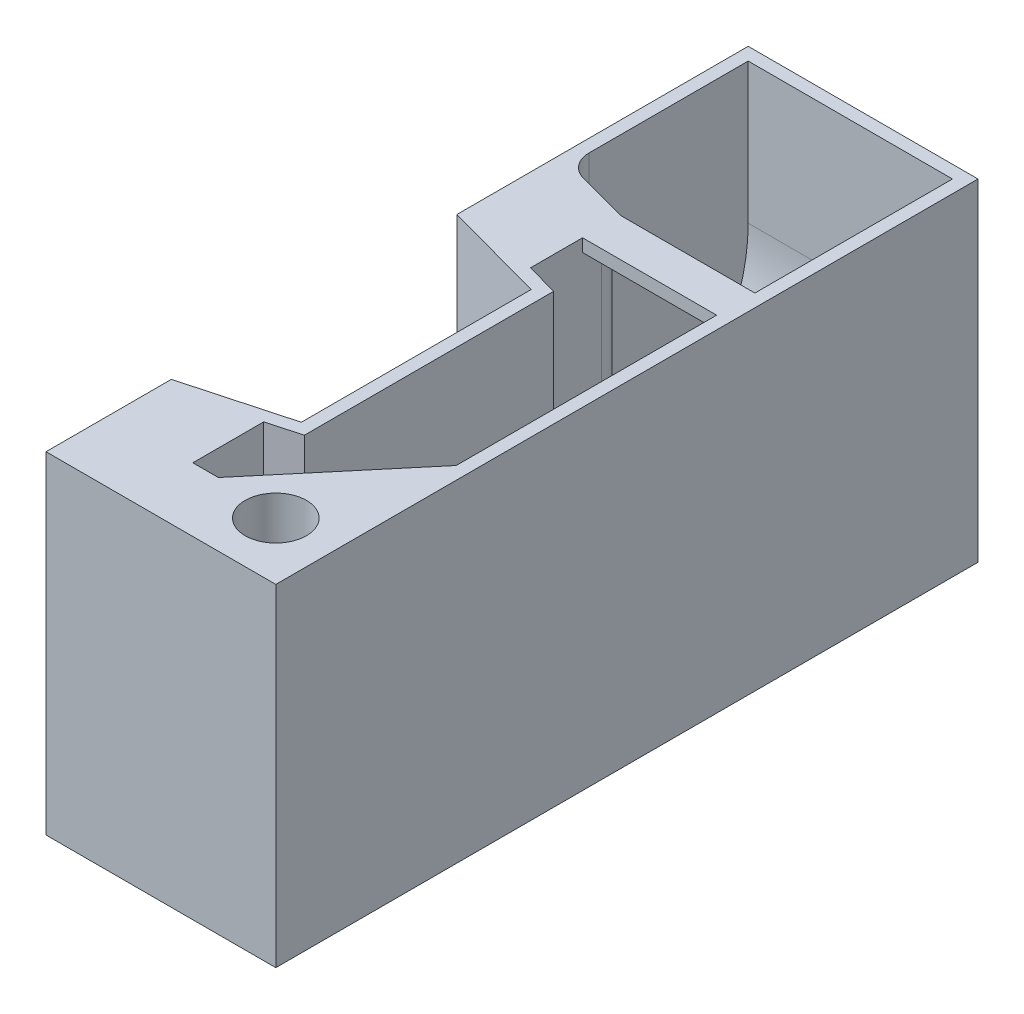
ISO-10303-21;
HEADER;
FILE_DESCRIPTION(('STEP AP214'),'2;1');
FILE_NAME('part.step','',(''),(''),'','','');
FILE_SCHEMA(('AUTOMOTIVE_DESIGN { 1 0 10303 214 1 1 1 1 }'));
ENDSEC;
DATA;
#1=APPLICATION_CONTEXT('core data for automotive mechanical design processes');
#2=APPLICATION_PROTOCOL_DEFINITION('international standard','automotive_design',2000,#1);
#3=PRODUCT_CONTEXT('',#1,'mechanical');
#4=PRODUCT('Part','Part','',(#3));
#5=PRODUCT_RELATED_PRODUCT_CATEGORY('part','',(#4));
#6=PRODUCT_DEFINITION_FORMATION('','',#4);
#7=PRODUCT_DEFINITION_CONTEXT('part definition',#1,'design');
#8=PRODUCT_DEFINITION('design','',#6,#7);
#9=PRODUCT_DEFINITION_SHAPE('','',#8);
#10=(LENGTH_UNIT() NAMED_UNIT(*) SI_UNIT(.MILLI.,.METRE.));
#11=(NAMED_UNIT(*) PLANE_ANGLE_UNIT() SI_UNIT($,.RADIAN.));
#12=(NAMED_UNIT(*) SI_UNIT($,.STERADIAN.) SOLID_ANGLE_UNIT());
#13=UNCERTAINTY_MEASURE_WITH_UNIT(LENGTH_MEASURE(1.E-05),#10,'distance_accuracy_value','');
#14=(GEOMETRIC_REPRESENTATION_CONTEXT(3) GLOBAL_UNCERTAINTY_ASSIGNED_CONTEXT((#13)) GLOBAL_UNIT_ASSIGNED_CONTEXT((#10,
#11,#12)) REPRESENTATION_CONTEXT('',''));
#15=CARTESIAN_POINT('',(0.,0.,0.));
#16=DIRECTION('',(0.,0.,1.));
#17=DIRECTION('',(1.,0.,0.));
#18=AXIS2_PLACEMENT_3D('',#15,#16,#17);
#19=CARTESIAN_POINT('',(13.5,-500000.,-18.5262794416288));
#20=DIRECTION('',(1.,0.,0.));
#21=DIRECTION('',(0.,0.,-1.));
#22=AXIS2_PLACEMENT_3D('',#19,#20,#21);
#23=PLANE('',#22);
#24=DIRECTION('',(0.,0.,-1.));
#25=VECTOR('',#24,1.);
#26=CARTESIAN_POINT('',(13.5,-24.9999999999773,-18.5262794416288));
#27=LINE('',#26,#25);
#28=CARTESIAN_POINT('',(13.5,-24.9999999999773,-15.));
#29=VERTEX_POINT('',#28);
#30=CARTESIAN_POINT('',(13.5,-24.9999999999773,-16.9916254656709));
#31=VERTEX_POINT('',#30);
#32=EDGE_CURVE('E492',#29,#31,#27,.T.);
#33=ORIENTED_EDGE('',*,*,#32,.T.);
#34=DIRECTION('',(0.,1.,0.));
#35=VECTOR('',#34,1.);
#36=CARTESIAN_POINT('',(13.5,-500000.,-16.9916254656709));
#37=LINE('',#36,#35);
#38=CARTESIAN_POINT('',(13.5,-23.1828332696509,-16.9916254656709));
#39=VERTEX_POINT('',#38);
#40=EDGE_CURVE('E474',#31,#39,#37,.T.);
#41=ORIENTED_EDGE('',*,*,#40,.T.);
#42=CARTESIAN_POINT('',(13.5,-23.,-15.));
#43=DIRECTION('',(1.,0.,0.));
#44=DIRECTION('',(0.,0.,-1.));
#45=AXIS2_PLACEMENT_3D('',#42,#43,#44);
#46=CIRCLE('',#45,2.);
#47=EDGE_CURVE('E340',#29,#39,#46,.T.);
#48=ORIENTED_EDGE('',*,*,#47,.F.);
#49=EDGE_LOOP('',(#33,#41,#48));
#50=FACE_BOUND('',#49,.T.);
#51=ADVANCED_FACE('F35',(#50),#23,.T.);
#52=CARTESIAN_POINT('',(13.5,-500000.,9.44605554080685));
#53=DIRECTION('',(1.,0.,0.));
#54=DIRECTION('',(0.,0.,-1.));
#55=AXIS2_PLACEMENT_3D('',#52,#53,#54);
#56=PLANE('',#55);
#57=DIRECTION('',(0.,1.,0.));
#58=VECTOR('',#57,1.);
#59=CARTESIAN_POINT('',(13.5,-26.,15.));
#60=LINE('',#59,#58);
#61=CARTESIAN_POINT('',(13.5,-25.0000000000909,15.));
#62=VERTEX_POINT('',#61);
#63=CARTESIAN_POINT('',(13.5,-23.,15.));
#64=VERTEX_POINT('',#63);
#65=EDGE_CURVE('E599',#62,#64,#60,.T.);
#66=ORIENTED_EDGE('',*,*,#65,.F.);
#67=DIRECTION('',(0.,0.,-1.));
#68=VECTOR('',#67,1.);
#69=CARTESIAN_POINT('',(13.5,-24.9999999999773,9.44605554080685));
#70=LINE('',#69,#68);
#71=CARTESIAN_POINT('',(13.5,-24.9999999999773,13.));
#72=VERTEX_POINT('',#71);
#73=EDGE_CURVE('E559',#62,#72,#70,.T.);
#74=ORIENTED_EDGE('',*,*,#73,.T.);
#75=CARTESIAN_POINT('',(13.5,-23.,13.));
#76=DIRECTION('',(1.,0.,0.));
#77=DIRECTION('',(0.,0.,-1.));
#78=AXIS2_PLACEMENT_3D('',#75,#76,#77);
#79=CIRCLE('',#78,2.);
#80=EDGE_CURVE('E339',#64,#72,#79,.T.);
#81=ORIENTED_EDGE('',*,*,#80,.F.);
#82=EDGE_LOOP('',(#66,#74,#81));
#83=FACE_BOUND('',#82,.T.);
#84=ADVANCED_FACE('F375',(#83),#56,.T.);
#85=CARTESIAN_POINT('',(15.,-26.,-10.));
#86=DIRECTION('',(0.263342239326898,0.,-0.964702474852374));
#87=DIRECTION('',(-0.964702474852374,0.,-0.263342239326898));
#88=AXIS2_PLACEMENT_3D('',#85,#86,#87);
#89=PLANE('',#88);
#90=DIRECTION('',(-0.964702474852374,0.,-0.263342239326898));
#91=VECTOR('',#90,1.);
#92=CARTESIAN_POINT('',(15.,0.,-10.));
#93=LINE('',#92,#91);
#94=CARTESIAN_POINT('',(15.,0.,-10.));
#95=VERTEX_POINT('',#94);
#96=CARTESIAN_POINT('',(7.,0.,-12.1838214055972));
#97=VERTEX_POINT('',#96);
#98=EDGE_CURVE('E284',#95,#97,#93,.T.);
#99=ORIENTED_EDGE('',*,*,#98,.T.);
#100=DIRECTION('',(0.,1.,0.));
#101=VECTOR('',#100,1.);
#102=CARTESIAN_POINT('',(7.,-26.,-12.1838214055972));
#103=LINE('',#102,#101);
#104=CARTESIAN_POINT('',(7.,-26.,-12.1838214055972));
#105=VERTEX_POINT('',#104);
#106=EDGE_CURVE('E321',#105,#97,#103,.T.);
#107=ORIENTED_EDGE('',*,*,#106,.F.);
#108=DIRECTION('',(-0.964702474852374,0.,-0.263342239326898));
#109=VECTOR('',#108,1.);
#110=CARTESIAN_POINT('',(15.,-26.,-10.));
#111=LINE('',#110,#109);
#112=CARTESIAN_POINT('',(15.,-26.,-10.));
#113=VERTEX_POINT('',#112);
#114=EDGE_CURVE('E265',#113,#105,#111,.T.);
#115=ORIENTED_EDGE('',*,*,#114,.F.);
#116=DIRECTION('',(0.,1.,0.));
#117=VECTOR('',#116,1.);
#118=CARTESIAN_POINT('',(15.,-26.,-10.));
#119=LINE('',#118,#117);
#120=EDGE_CURVE('E283',#113,#95,#119,.T.);
#121=ORIENTED_EDGE('',*,*,#120,.T.);
#122=EDGE_LOOP('',(#99,#107,#115,#121));
#123=FACE_BOUND('',#122,.T.);
#124=ADVANCED_FACE('F371',(#123),#89,.F.);
#125=CARTESIAN_POINT('',(7.,-26.,-12.1838214055972));
#126=DIRECTION('',(1.,0.,0.));
#127=DIRECTION('',(0.,0.,-1.));
#128=AXIS2_PLACEMENT_3D('',#125,#126,#127);
#129=PLANE('',#128);
#130=CARTESIAN_POINT('',(7.,-23.,-15.));
#131=DIRECTION('',(-1.,0.,0.));
#132=DIRECTION('',(0.,0.,1.));
#133=AXIS2_PLACEMENT_3D('',#130,#131,#132);
#134=CIRCLE('',#133,2.);
#135=CARTESIAN_POINT('',(7.,-23.,-13.));
#136=VERTEX_POINT('',#135);
#137=EDGE_CURVE('E594',#136,#136,#134,.T.);
#138=ORIENTED_EDGE('',*,*,#137,.F.);
#139=EDGE_LOOP('',(#138));
#140=FACE_BOUND('',#139,.T.);
#141=DIRECTION('',(0.,0.,-1.));
#142=VECTOR('',#141,1.);
#143=CARTESIAN_POINT('',(7.,0.,-12.1838214055972));
#144=LINE('',#143,#142);
#145=CARTESIAN_POINT('',(7.00000000000001,0.,-35.));
#146=VERTEX_POINT('',#145);
#147=EDGE_CURVE('E287',#97,#146,#144,.T.);
#148=ORIENTED_EDGE('',*,*,#147,.T.);
#149=DIRECTION('',(0.,1.,0.));
#150=VECTOR('',#149,1.);
#151=CARTESIAN_POINT('',(7.00000000000001,-26.,-35.));
#152=LINE('',#151,#150);
#153=CARTESIAN_POINT('',(7.00000000000001,-26.,-35.));
#154=VERTEX_POINT('',#153);
#155=EDGE_CURVE('E318',#154,#146,#152,.T.);
#156=ORIENTED_EDGE('',*,*,#155,.F.);
#157=DIRECTION('',(0.,0.,-1.));
#158=VECTOR('',#157,1.);
#159=CARTESIAN_POINT('',(7.,-26.,-12.1838214055972));
#160=LINE('',#159,#158);
#161=EDGE_CURVE('E268',#105,#154,#160,.T.);
#162=ORIENTED_EDGE('',*,*,#161,.F.);
#163=ORIENTED_EDGE('',*,*,#106,.T.);
#164=EDGE_LOOP('',(#148,#156,#162,#163));
#165=FACE_BOUND('',#164,.T.);
#166=ADVANCED_FACE('F374',(#140,#165),#129,.F.);
#167=CARTESIAN_POINT('',(7.00000000000001,-26.,-35.));
#168=DIRECTION('',(0.,0.,1.));
#169=DIRECTION('',(1.,0.,0.));
#170=AXIS2_PLACEMENT_3D('',#167,#168,#169);
#171=PLANE('',#170);
#172=DIRECTION('',(1.,0.,0.));
#173=VECTOR('',#172,1.);
#174=CARTESIAN_POINT('',(7.00000000000001,0.,-35.));
#175=LINE('',#174,#173);
#176=CARTESIAN_POINT('',(25.,0.,-35.));
#177=VERTEX_POINT('',#176);
#178=EDGE_CURVE('E290',#146,#177,#175,.T.);
#179=ORIENTED_EDGE('',*,*,#178,.T.);
#180=DIRECTION('',(0.,1.,0.));
#181=VECTOR('',#180,1.);
#182=CARTESIAN_POINT('',(25.,-26.,-35.));
#183=LINE('',#182,#181);
#184=CARTESIAN_POINT('',(25.,-26.,-35.));
#185=VERTEX_POINT('',#184);
#186=EDGE_CURVE('E315',#185,#177,#183,.T.);
#187=ORIENTED_EDGE('',*,*,#186,.F.);
#188=DIRECTION('',(1.,0.,0.));
#189=VECTOR('',#188,1.);
#190=CARTESIAN_POINT('',(7.00000000000001,-26.,-35.));
#191=LINE('',#190,#189);
#192=EDGE_CURVE('E271',#154,#185,#191,.T.);
#193=ORIENTED_EDGE('',*,*,#192,.F.);
#194=ORIENTED_EDGE('',*,*,#155,.T.);
#195=EDGE_LOOP('',(#179,#187,#193,#194));
#196=FACE_BOUND('',#195,.T.);
#197=ADVANCED_FACE('F379',(#196),#171,.F.);
#198=CARTESIAN_POINT('',(25.,-26.,-35.));
#199=DIRECTION('',(-1.,0.,0.));
#200=DIRECTION('',(0.,0.,1.));
#201=AXIS2_PLACEMENT_3D('',#198,#199,#200);
#202=PLANE('',#201);
#203=DIRECTION('',(0.,0.,1.));
#204=VECTOR('',#203,1.);
#205=CARTESIAN_POINT('',(25.,0.,-35.));
#206=LINE('',#205,#204);
#207=CARTESIAN_POINT('',(25.,0.,20.));
#208=VERTEX_POINT('',#207);
#209=EDGE_CURVE('E292',#177,#208,#206,.T.);
#210=ORIENTED_EDGE('',*,*,#209,.T.);
#211=DIRECTION('',(0.,1.,0.));
#212=VECTOR('',#211,1.);
#213=CARTESIAN_POINT('',(25.,-26.,20.));
#214=LINE('',#213,#212);
#215=CARTESIAN_POINT('',(25.,-26.,20.));
#216=VERTEX_POINT('',#215);
#217=EDGE_CURVE('E312',#216,#208,#214,.T.);
#218=ORIENTED_EDGE('',*,*,#217,.F.);
#219=DIRECTION('',(0.,0.,1.));
#220=VECTOR('',#219,1.);
#221=CARTESIAN_POINT('',(25.,-26.,-35.));
#222=LINE('',#221,#220);
#223=EDGE_CURVE('E273',#185,#216,#222,.T.);
#224=ORIENTED_EDGE('',*,*,#223,.F.);
#225=ORIENTED_EDGE('',*,*,#186,.T.);
#226=EDGE_LOOP('',(#210,#218,#224,#225));
#227=FACE_BOUND('',#226,.T.);
#228=ADVANCED_FACE('F383',(#227),#202,.F.);
#229=CARTESIAN_POINT('',(25.,-26.,20.));
#230=DIRECTION('',(0.,0.,-1.));
#231=DIRECTION('',(-1.,0.,0.));
#232=AXIS2_PLACEMENT_3D('',#229,#230,#231);
#233=PLANE('',#232);
#234=DIRECTION('',(-1.,0.,0.));
#235=VECTOR('',#234,1.);
#236=CARTESIAN_POINT('',(25.,0.,20.));
#237=LINE('',#236,#235);
#238=CARTESIAN_POINT('',(7.,0.,20.));
#239=VERTEX_POINT('',#238);
#240=EDGE_CURVE('E294',#208,#239,#237,.T.);
#241=ORIENTED_EDGE('',*,*,#240,.T.);
#242=DIRECTION('',(0.,1.,0.));
#243=VECTOR('',#242,1.);
#244=CARTESIAN_POINT('',(7.,-26.,20.));
#245=LINE('',#244,#243);
#246=CARTESIAN_POINT('',(7.,-26.,20.));
#247=VERTEX_POINT('',#246);
#248=EDGE_CURVE('E309',#247,#239,#245,.T.);
#249=ORIENTED_EDGE('',*,*,#248,.F.);
#250=DIRECTION('',(-1.,0.,0.));
#251=VECTOR('',#250,1.);
#252=CARTESIAN_POINT('',(25.,-26.,20.));
#253=LINE('',#252,#251);
#254=EDGE_CURVE('E275',#216,#247,#253,.T.);
#255=ORIENTED_EDGE('',*,*,#254,.F.);
#256=ORIENTED_EDGE('',*,*,#217,.T.);
#257=EDGE_LOOP('',(#241,#249,#255,#256));
#258=FACE_BOUND('',#257,.T.);
#259=ADVANCED_FACE('F387',(#258),#233,.F.);
#260=CARTESIAN_POINT('',(7.,-26.,20.));
#261=DIRECTION('',(1.,0.,0.));
#262=DIRECTION('',(0.,0.,-1.));
#263=AXIS2_PLACEMENT_3D('',#260,#261,#262);
#264=PLANE('',#263);
#265=CARTESIAN_POINT('',(7.,-23.,13.));
#266=DIRECTION('',(-1.,0.,0.));
#267=DIRECTION('',(0.,0.,1.));
#268=AXIS2_PLACEMENT_3D('',#265,#266,#267);
#269=CIRCLE('',#268,2.);
#270=CARTESIAN_POINT('',(7.,-23.,15.));
#271=VERTEX_POINT('',#270);
#272=EDGE_CURVE('E591',#271,#271,#269,.T.);
#273=ORIENTED_EDGE('',*,*,#272,.F.);
#274=EDGE_LOOP('',(#273));
#275=FACE_BOUND('',#274,.T.);
#276=DIRECTION('',(0.,0.,-1.));
#277=VECTOR('',#276,1.);
#278=CARTESIAN_POINT('',(7.,0.,20.));
#279=LINE('',#278,#277);
#280=CARTESIAN_POINT('',(7.,0.,10.1838214055972));
#281=VERTEX_POINT('',#280);
#282=EDGE_CURVE('E296',#239,#281,#279,.T.);
#283=ORIENTED_EDGE('',*,*,#282,.T.);
#284=DIRECTION('',(0.,1.,0.));
#285=VECTOR('',#284,1.);
#286=CARTESIAN_POINT('',(7.,-26.,10.1838214055972));
#287=LINE('',#286,#285);
#288=CARTESIAN_POINT('',(7.,-26.,10.1838214055972));
#289=VERTEX_POINT('',#288);
#290=EDGE_CURVE('E306',#289,#281,#287,.T.);
#291=ORIENTED_EDGE('',*,*,#290,.F.);
#292=DIRECTION('',(0.,0.,-1.));
#293=VECTOR('',#292,1.);
#294=CARTESIAN_POINT('',(7.,-26.,20.));
#295=LINE('',#294,#293);
#296=EDGE_CURVE('E277',#247,#289,#295,.T.);
#297=ORIENTED_EDGE('',*,*,#296,.F.);
#298=ORIENTED_EDGE('',*,*,#248,.T.);
#299=EDGE_LOOP('',(#283,#291,#297,#298));
#300=FACE_BOUND('',#299,.T.);
#301=ADVANCED_FACE('F391',(#275,#300),#264,.F.);
#302=CARTESIAN_POINT('',(7.,-26.,10.1838214055972));
#303=DIRECTION('',(0.263342239326903,0.,0.964702474852372));
#304=DIRECTION('',(0.964702474852372,0.,-0.263342239326903));
#305=AXIS2_PLACEMENT_3D('',#302,#303,#304);
#306=PLANE('',#305);
#307=DIRECTION('',(0.964702474852372,0.,-0.263342239326903));
#308=VECTOR('',#307,1.);
#309=CARTESIAN_POINT('',(7.,0.,10.1838214055972));
#310=LINE('',#309,#308);
#311=CARTESIAN_POINT('',(15.,0.,8.));
#312=VERTEX_POINT('',#311);
#313=EDGE_CURVE('E298',#281,#312,#310,.T.);
#314=ORIENTED_EDGE('',*,*,#313,.T.);
#315=DIRECTION('',(0.,1.,0.));
#316=VECTOR('',#315,1.);
#317=CARTESIAN_POINT('',(15.,-26.,8.));
#318=LINE('',#317,#316);
#319=CARTESIAN_POINT('',(15.,-26.,8.));
#320=VERTEX_POINT('',#319);
#321=EDGE_CURVE('E303',#320,#312,#318,.T.);
#322=ORIENTED_EDGE('',*,*,#321,.F.);
#323=DIRECTION('',(0.964702474852372,0.,-0.263342239326903));
#324=VECTOR('',#323,1.);
#325=CARTESIAN_POINT('',(7.,-26.,10.1838214055972));
#326=LINE('',#325,#324);
#327=EDGE_CURVE('E279',#289,#320,#326,.T.);
#328=ORIENTED_EDGE('',*,*,#327,.F.);
#329=ORIENTED_EDGE('',*,*,#290,.T.);
#330=EDGE_LOOP('',(#314,#322,#328,#329));
#331=FACE_BOUND('',#330,.T.);
#332=ADVANCED_FACE('F395',(#331),#306,.F.);
#333=CARTESIAN_POINT('',(15.,-26.,8.));
#334=DIRECTION('',(1.,0.,0.));
#335=DIRECTION('',(0.,0.,-1.));
#336=AXIS2_PLACEMENT_3D('',#333,#334,#335);
#337=PLANE('',#336);
#338=DIRECTION('',(0.,0.,-1.));
#339=VECTOR('',#338,1.);
#340=CARTESIAN_POINT('',(15.,0.,8.));
#341=LINE('',#340,#339);
#342=EDGE_CURVE('E269',#312,#95,#341,.T.);
#343=ORIENTED_EDGE('',*,*,#342,.T.);
#344=ORIENTED_EDGE('',*,*,#120,.F.);
#345=DIRECTION('',(0.,0.,-1.));
#346=VECTOR('',#345,1.);
#347=CARTESIAN_POINT('',(15.,-26.,8.));
#348=LINE('',#347,#346);
#349=EDGE_CURVE('E281',#320,#113,#348,.T.);
#350=ORIENTED_EDGE('',*,*,#349,.F.);
#351=ORIENTED_EDGE('',*,*,#321,.T.);
#352=EDGE_LOOP('',(#343,#344,#350,#351));
#353=FACE_BOUND('',#352,.T.);
#354=ADVANCED_FACE('F399',(#353),#337,.F.);
#355=CARTESIAN_POINT('',(0.,-26.,0.));
#356=DIRECTION('',(0.,-1.,0.));
#357=DIRECTION('',(0.,0.,-1.));
#358=AXIS2_PLACEMENT_3D('',#355,#356,#357);
#359=PLANE('',#358);
#360=ORIENTED_EDGE('',*,*,#114,.T.);
#361=ORIENTED_EDGE('',*,*,#161,.T.);
#362=ORIENTED_EDGE('',*,*,#192,.T.);
#363=ORIENTED_EDGE('',*,*,#223,.T.);
#364=ORIENTED_EDGE('',*,*,#254,.T.);
#365=ORIENTED_EDGE('',*,*,#296,.T.);
#366=ORIENTED_EDGE('',*,*,#327,.T.);
#367=ORIENTED_EDGE('',*,*,#349,.T.);
#368=EDGE_LOOP('',(#360,#361,#362,#363,#364,#365,#366,#367));
#369=FACE_BOUND('',#368,.T.);
#370=ADVANCED_FACE('F403',(#369),#359,.T.);
#371=CARTESIAN_POINT('',(0.,0.,0.));
#372=DIRECTION('',(0.,-1.,0.));
#373=DIRECTION('',(0.,0.,-1.));
#374=AXIS2_PLACEMENT_3D('',#371,#372,#373);
#375=PLANE('',#374);
#376=CARTESIAN_POINT('',(20.5,0.,15.5));
#377=DIRECTION('',(0.,1.,0.));
#378=DIRECTION('',(0.,0.,1.));
#379=AXIS2_PLACEMENT_3D('',#376,#377,#378);
#380=CIRCLE('',#379,2.4);
#381=CARTESIAN_POINT('',(20.5,0.,17.9));
#382=VERTEX_POINT('',#381);
#383=EDGE_CURVE('E605',#382,#382,#380,.T.);
#384=ORIENTED_EDGE('',*,*,#383,.F.);
#385=EDGE_LOOP('',(#384));
#386=FACE_BOUND('',#385,.T.);
#387=DIRECTION('',(0.,0.,1.));
#388=VECTOR('',#387,1.);
#389=CARTESIAN_POINT('',(24.,0.,-35.));
#390=LINE('',#389,#388);
#391=CARTESIAN_POINT('',(24.,0.,-15.5262794416288));
#392=VERTEX_POINT('',#391);
#393=CARTESIAN_POINT('',(24.,0.,4.87009446294933));
#394=VERTEX_POINT('',#393);
#395=EDGE_CURVE('E243',#392,#394,#390,.T.);
#396=ORIENTED_EDGE('',*,*,#395,.T.);
#397=DIRECTION('',(-0.642787609686543,0.,0.766044443118974));
#398=VECTOR('',#397,1.);
#399=CARTESIAN_POINT('',(24.,0.,4.87009446294933));
#400=LINE('',#399,#398);
#401=CARTESIAN_POINT('',(15.5,0.,15.));
#402=VERTEX_POINT('',#401);
#403=EDGE_CURVE('E224',#394,#402,#400,.T.);
#404=ORIENTED_EDGE('',*,*,#403,.T.);
#405=DIRECTION('',(-1.,0.,0.));
#406=VECTOR('',#405,1.);
#407=CARTESIAN_POINT('',(13.5,0.,15.));
#408=LINE('',#407,#406);
#409=CARTESIAN_POINT('',(13.5,0.,15.));
#410=VERTEX_POINT('',#409);
#411=EDGE_CURVE('E235',#402,#410,#408,.T.);
#412=ORIENTED_EDGE('',*,*,#411,.T.);
#413=DIRECTION('',(0.,0.,-1.));
#414=VECTOR('',#413,1.);
#415=CARTESIAN_POINT('',(13.5,0.,9.44605554080685));
#416=LINE('',#415,#414);
#417=CARTESIAN_POINT('',(13.5,0.,9.44605554080685));
#418=VERTEX_POINT('',#417);
#419=EDGE_CURVE('E498',#410,#418,#416,.T.);
#420=ORIENTED_EDGE('',*,*,#419,.T.);
#421=DIRECTION('',(0.964702474852372,0.,-0.263342239326903));
#422=VECTOR('',#421,1.);
#423=CARTESIAN_POINT('',(7.2633422393269,0.,11.1485238804496));
#424=LINE('',#423,#422);
#425=CARTESIAN_POINT('',(16.,0.,8.76361135155772));
#426=VERTEX_POINT('',#425);
#427=EDGE_CURVE('E256',#418,#426,#424,.T.);
#428=ORIENTED_EDGE('',*,*,#427,.T.);
#429=DIRECTION('',(0.,0.,-1.));
#430=VECTOR('',#429,1.);
#431=CARTESIAN_POINT('',(16.,0.,8.));
#432=LINE('',#431,#430);
#433=CARTESIAN_POINT('',(16.,0.,-10.7636113515577));
#434=VERTEX_POINT('',#433);
#435=EDGE_CURVE('E516',#426,#434,#432,.T.);
#436=ORIENTED_EDGE('',*,*,#435,.T.);
#437=DIRECTION('',(-0.964702474852374,0.,-0.263342239326898));
#438=VECTOR('',#437,1.);
#439=CARTESIAN_POINT('',(15.2633422393269,0.,-10.9647024748524));
#440=LINE('',#439,#438);
#441=CARTESIAN_POINT('',(13.5,0.,-11.4460555408068));
#442=VERTEX_POINT('',#441);
#443=EDGE_CURVE('E264',#434,#442,#440,.T.);
#444=ORIENTED_EDGE('',*,*,#443,.T.);
#445=DIRECTION('',(0.,0.,-1.));
#446=VECTOR('',#445,1.);
#447=CARTESIAN_POINT('',(13.5,0.,-18.5262794416288));
#448=LINE('',#447,#446);
#449=CARTESIAN_POINT('',(13.5,0.,-15.5262794416288));
#450=VERTEX_POINT('',#449);
#451=EDGE_CURVE('E506',#442,#450,#448,.T.);
#452=ORIENTED_EDGE('',*,*,#451,.T.);
#453=DIRECTION('',(1.,0.,0.));
#454=VECTOR('',#453,1.);
#455=CARTESIAN_POINT('',(24.,0.,-15.5262794416288));
#456=LINE('',#455,#454);
#457=EDGE_CURVE('E250',#450,#392,#456,.T.);
#458=ORIENTED_EDGE('',*,*,#457,.T.);
#459=EDGE_LOOP('',(#396,#404,#412,#420,#428,#436,#444,#452,#458));
#460=FACE_BOUND('',#459,.T.);
#461=CARTESIAN_POINT('',(24.,0.,-34.));
#462=VERTEX_POINT('',#461);
#463=CARTESIAN_POINT('',(24.,0.,-18.5262794416288));
#464=VERTEX_POINT('',#463);
#465=EDGE_CURVE('E252',#462,#464,#390,.T.);
#466=ORIENTED_EDGE('',*,*,#465,.T.);
#467=DIRECTION('',(-1.,0.,0.));
#468=VECTOR('',#467,1.);
#469=CARTESIAN_POINT('',(24.,0.,-18.5262794416288));
#470=LINE('',#469,#468);
#471=CARTESIAN_POINT('',(13.5,0.,-18.5262794416288));
#472=VERTEX_POINT('',#471);
#473=EDGE_CURVE('E343',#464,#472,#470,.T.);
#474=ORIENTED_EDGE('',*,*,#473,.T.);
#475=DIRECTION('',(-0.965925826289067,0.,-0.258819045102525));
#476=VECTOR('',#475,1.);
#477=CARTESIAN_POINT('',(8.,0.,-20.));
#478=LINE('',#477,#476);
#479=CARTESIAN_POINT('',(9.48236190979495,0.,-19.6028023233798));
#480=VERTEX_POINT('',#479);
#481=EDGE_CURVE('E508',#472,#480,#478,.T.);
#482=ORIENTED_EDGE('',*,*,#481,.T.);
#483=CARTESIAN_POINT('',(10.,0.,-21.5346539759579));
#484=DIRECTION('',(0.,-1.,0.));
#485=DIRECTION('',(0.,0.,-1.));
#486=AXIS2_PLACEMENT_3D('',#483,#484,#485);
#487=CIRCLE('',#486,2.);
#488=CARTESIAN_POINT('',(8.,0.,-21.5346539759579));
#489=VERTEX_POINT('',#488);
#490=EDGE_CURVE('E473',#480,#489,#487,.T.);
#491=ORIENTED_EDGE('',*,*,#490,.T.);
#492=DIRECTION('',(0.,0.,-1.));
#493=VECTOR('',#492,1.);
#494=CARTESIAN_POINT('',(8.,0.,-12.1838214055972));
#495=LINE('',#494,#493);
#496=CARTESIAN_POINT('',(8.00000000000001,0.,-34.));
#497=VERTEX_POINT('',#496);
#498=EDGE_CURVE('E258',#489,#497,#495,.T.);
#499=ORIENTED_EDGE('',*,*,#498,.T.);
#500=DIRECTION('',(1.,0.,0.));
#501=VECTOR('',#500,1.);
#502=CARTESIAN_POINT('',(7.00000000000001,0.,-34.));
#503=LINE('',#502,#501);
#504=EDGE_CURVE('E253',#497,#462,#503,.T.);
#505=ORIENTED_EDGE('',*,*,#504,.T.);
#506=EDGE_LOOP('',(#466,#474,#482,#491,#499,#505));
#507=FACE_BOUND('',#506,.T.);
#508=ORIENTED_EDGE('',*,*,#98,.F.);
#509=ORIENTED_EDGE('',*,*,#342,.F.);
#510=ORIENTED_EDGE('',*,*,#313,.F.);
#511=ORIENTED_EDGE('',*,*,#282,.F.);
#512=ORIENTED_EDGE('',*,*,#240,.F.);
#513=ORIENTED_EDGE('',*,*,#209,.F.);
#514=ORIENTED_EDGE('',*,*,#178,.F.);
#515=ORIENTED_EDGE('',*,*,#147,.F.);
#516=EDGE_LOOP('',(#508,#509,#510,#511,#512,#513,#514,#515));
#517=FACE_BOUND('',#516,.T.);
#518=ADVANCED_FACE('F247',(#386,#460,#507,#517),#375,.F.);
#519=CARTESIAN_POINT('',(15.2633422393269,-26.,-10.9647024748524));
#520=DIRECTION('',(0.263342239326898,0.,-0.964702474852374));
#521=DIRECTION('',(-0.964702474852374,0.,-0.263342239326898));
#522=AXIS2_PLACEMENT_3D('',#519,#520,#521);
#523=PLANE('',#522);
#524=DIRECTION('',(0.,1.,0.));
#525=VECTOR('',#524,1.);
#526=CARTESIAN_POINT('',(13.5,-500000.,-11.4460555408068));
#527=LINE('',#526,#525);
#528=CARTESIAN_POINT('',(13.5,-25.,-11.4460555408068));
#529=VERTEX_POINT('',#528);
#530=EDGE_CURVE('E505',#529,#442,#527,.T.);
#531=ORIENTED_EDGE('',*,*,#530,.T.);
#532=ORIENTED_EDGE('',*,*,#443,.F.);
#533=DIRECTION('',(0.,1.,0.));
#534=VECTOR('',#533,1.);
#535=CARTESIAN_POINT('',(16.,-26.,-10.7636113515577));
#536=LINE('',#535,#534);
#537=CARTESIAN_POINT('',(16.,-25.,-10.7636113515577));
#538=VERTEX_POINT('',#537);
#539=EDGE_CURVE('E517',#538,#434,#536,.T.);
#540=ORIENTED_EDGE('',*,*,#539,.F.);
#541=DIRECTION('',(-0.964702474852374,0.,-0.263342239326898));
#542=VECTOR('',#541,1.);
#543=CARTESIAN_POINT('',(15.2633422393269,-25.,-10.9647024748524));
#544=LINE('',#543,#542);
#545=EDGE_CURVE('E513',#538,#529,#544,.T.);
#546=ORIENTED_EDGE('',*,*,#545,.T.);
#547=EDGE_LOOP('',(#531,#532,#540,#546));
#548=FACE_BOUND('',#547,.T.);
#549=ADVANCED_FACE('F407',(#548),#523,.T.);
#550=CARTESIAN_POINT('',(8.,-26.,-12.1838214055972));
#551=DIRECTION('',(1.,0.,0.));
#552=DIRECTION('',(0.,0.,-1.));
#553=AXIS2_PLACEMENT_3D('',#550,#551,#552);
#554=PLANE('',#553);
#555=ORIENTED_EDGE('',*,*,#498,.F.);
#556=DIRECTION('',(0.,1.,0.));
#557=VECTOR('',#556,1.);
#558=CARTESIAN_POINT('',(8.,-24.9999999999773,-21.5346539759579));
#559=LINE('',#558,#557);
#560=CARTESIAN_POINT('',(8.,-24.9156328341214,-21.5346539759579));
#561=VERTEX_POINT('',#560);
#562=EDGE_CURVE('E351',#489,#561,#559,.F.);
#563=ORIENTED_EDGE('',*,*,#562,.T.);
#564=CARTESIAN_POINT('',(8.,-11.,-20.));
#565=DIRECTION('',(1.,0.,0.));
#566=DIRECTION('',(0.,0.,-1.));
#567=AXIS2_PLACEMENT_3D('',#564,#565,#566);
#568=CIRCLE('',#567,14.);
#569=CARTESIAN_POINT('',(8.00000000000001,-11.,-34.));
#570=VERTEX_POINT('',#569);
#571=EDGE_CURVE('E332',#561,#570,#568,.T.);
#572=ORIENTED_EDGE('',*,*,#571,.T.);
#573=DIRECTION('',(0.,1.,0.));
#574=VECTOR('',#573,1.);
#575=CARTESIAN_POINT('',(8.00000000000001,-26.,-34.));
#576=LINE('',#575,#574);
#577=EDGE_CURVE('E288',#570,#497,#576,.T.);
#578=ORIENTED_EDGE('',*,*,#577,.T.);
#579=EDGE_LOOP('',(#555,#563,#572,#578));
#580=FACE_BOUND('',#579,.T.);
#581=ADVANCED_FACE('F428',(#580),#554,.T.);
#582=CARTESIAN_POINT('',(7.00000000000001,-26.,-34.));
#583=DIRECTION('',(0.,0.,1.));
#584=DIRECTION('',(1.,0.,0.));
#585=AXIS2_PLACEMENT_3D('',#582,#583,#584);
#586=PLANE('',#585);
#587=ORIENTED_EDGE('',*,*,#577,.F.);
#588=DIRECTION('',(1.,0.,0.));
#589=VECTOR('',#588,1.);
#590=CARTESIAN_POINT('',(7.00000000000001,-11.,-34.));
#591=LINE('',#590,#589);
#592=CARTESIAN_POINT('',(24.,-11.,-34.));
#593=VERTEX_POINT('',#592);
#594=EDGE_CURVE('E324',#570,#593,#591,.T.);
#595=ORIENTED_EDGE('',*,*,#594,.T.);
#596=DIRECTION('',(0.,1.,0.));
#597=VECTOR('',#596,1.);
#598=CARTESIAN_POINT('',(24.,-26.,-34.));
#599=LINE('',#598,#597);
#600=EDGE_CURVE('E523',#593,#462,#599,.T.);
#601=ORIENTED_EDGE('',*,*,#600,.T.);
#602=ORIENTED_EDGE('',*,*,#504,.F.);
#603=EDGE_LOOP('',(#587,#595,#601,#602));
#604=FACE_BOUND('',#603,.T.);
#605=ADVANCED_FACE('F425',(#604),#586,.T.);
#606=CARTESIAN_POINT('',(24.,-26.,-35.));
#607=DIRECTION('',(-1.,0.,0.));
#608=DIRECTION('',(0.,0.,1.));
#609=AXIS2_PLACEMENT_3D('',#606,#607,#608);
#610=PLANE('',#609);
#611=DIRECTION('',(0.,1.,0.));
#612=VECTOR('',#611,1.);
#613=CARTESIAN_POINT('',(24.,-26.,4.87009446294933));
#614=LINE('',#613,#612);
#615=CARTESIAN_POINT('',(24.,-25.,4.87009446294933));
#616=VERTEX_POINT('',#615);
#617=EDGE_CURVE('E227',#616,#394,#614,.T.);
#618=ORIENTED_EDGE('',*,*,#617,.T.);
#619=ORIENTED_EDGE('',*,*,#395,.F.);
#620=DIRECTION('',(0.,1.,0.));
#621=VECTOR('',#620,1.);
#622=CARTESIAN_POINT('',(24.,-1.,-15.5262794416288));
#623=LINE('',#622,#621);
#624=CARTESIAN_POINT('',(24.,-1.,-15.5262794416288));
#625=VERTEX_POINT('',#624);
#626=EDGE_CURVE('E548',#625,#392,#623,.T.);
#627=ORIENTED_EDGE('',*,*,#626,.F.);
#628=DIRECTION('',(0.,0.,-1.));
#629=VECTOR('',#628,1.);
#630=CARTESIAN_POINT('',(24.,-1.,-15.5262794416288));
#631=LINE('',#630,#629);
#632=CARTESIAN_POINT('',(24.,-1.,-18.5262794416288));
#633=VERTEX_POINT('',#632);
#634=EDGE_CURVE('E583',#625,#633,#631,.T.);
#635=ORIENTED_EDGE('',*,*,#634,.T.);
#636=DIRECTION('',(0.,1.,0.));
#637=VECTOR('',#636,1.);
#638=CARTESIAN_POINT('',(24.,-1.,-18.5262794416288));
#639=LINE('',#638,#637);
#640=EDGE_CURVE('E552',#633,#464,#639,.T.);
#641=ORIENTED_EDGE('',*,*,#640,.T.);
#642=ORIENTED_EDGE('',*,*,#465,.F.);
#643=ORIENTED_EDGE('',*,*,#600,.F.);
#644=CARTESIAN_POINT('',(24.,-11.,-20.));
#645=DIRECTION('',(-1.,0.,0.));
#646=DIRECTION('',(0.,0.,1.));
#647=AXIS2_PLACEMENT_3D('',#644,#645,#646);
#648=CIRCLE('',#647,14.);
#649=CARTESIAN_POINT('',(24.,-25.,-20.));
#650=VERTEX_POINT('',#649);
#651=EDGE_CURVE('E327',#593,#650,#648,.T.);
#652=ORIENTED_EDGE('',*,*,#651,.T.);
#653=DIRECTION('',(0.,0.,1.));
#654=VECTOR('',#653,1.);
#655=CARTESIAN_POINT('',(24.,-25.,-35.));
#656=LINE('',#655,#654);
#657=EDGE_CURVE('E245',#650,#616,#656,.T.);
#658=ORIENTED_EDGE('',*,*,#657,.T.);
#659=EDGE_LOOP('',(#618,#619,#627,#635,#641,#642,#643,#652,#658));
#660=FACE_BOUND('',#659,.T.);
#661=ADVANCED_FACE('F241',(#660),#610,.T.);
#662=CARTESIAN_POINT('',(7.2633422393269,-26.,11.1485238804496));
#663=DIRECTION('',(0.263342239326903,0.,0.964702474852372));
#664=DIRECTION('',(0.964702474852372,0.,-0.263342239326903));
#665=AXIS2_PLACEMENT_3D('',#662,#663,#664);
#666=PLANE('',#665);
#667=DIRECTION('',(0.,1.,0.));
#668=VECTOR('',#667,1.);
#669=CARTESIAN_POINT('',(13.5,-500000.,9.44605554080685));
#670=LINE('',#669,#668);
#671=CARTESIAN_POINT('',(13.5,-25.0000000000909,9.44605554080685));
#672=VERTEX_POINT('',#671);
#673=EDGE_CURVE('E500',#672,#418,#670,.T.);
#674=ORIENTED_EDGE('',*,*,#673,.F.);
#675=DIRECTION('',(0.964702474852372,0.,-0.263342239326903));
#676=VECTOR('',#675,1.);
#677=CARTESIAN_POINT('',(7.2633422393269,-25.,11.1485238804496));
#678=LINE('',#677,#676);
#679=CARTESIAN_POINT('',(16.,-25.,8.76361135155772));
#680=VERTEX_POINT('',#679);
#681=EDGE_CURVE('E526',#672,#680,#678,.T.);
#682=ORIENTED_EDGE('',*,*,#681,.T.);
#683=DIRECTION('',(0.,1.,0.));
#684=VECTOR('',#683,1.);
#685=CARTESIAN_POINT('',(16.,-26.,8.76361135155772));
#686=LINE('',#685,#684);
#687=EDGE_CURVE('E519',#680,#426,#686,.T.);
#688=ORIENTED_EDGE('',*,*,#687,.T.);
#689=ORIENTED_EDGE('',*,*,#427,.F.);
#690=EDGE_LOOP('',(#674,#682,#688,#689));
#691=FACE_BOUND('',#690,.T.);
#692=ADVANCED_FACE('F418',(#691),#666,.T.);
#693=CARTESIAN_POINT('',(16.,-26.,8.));
#694=DIRECTION('',(1.,0.,0.));
#695=DIRECTION('',(0.,0.,-1.));
#696=AXIS2_PLACEMENT_3D('',#693,#694,#695);
#697=PLANE('',#696);
#698=ORIENTED_EDGE('',*,*,#435,.F.);
#699=ORIENTED_EDGE('',*,*,#687,.F.);
#700=DIRECTION('',(0.,0.,-1.));
#701=VECTOR('',#700,1.);
#702=CARTESIAN_POINT('',(16.,-25.,8.));
#703=LINE('',#702,#701);
#704=EDGE_CURVE('E520',#680,#538,#703,.T.);
#705=ORIENTED_EDGE('',*,*,#704,.T.);
#706=ORIENTED_EDGE('',*,*,#539,.T.);
#707=EDGE_LOOP('',(#698,#699,#705,#706));
#708=FACE_BOUND('',#707,.T.);
#709=ADVANCED_FACE('F414',(#708),#697,.T.);
#710=CARTESIAN_POINT('',(0.,-25.,0.));
#711=DIRECTION('',(0.,-1.,0.));
#712=DIRECTION('',(0.,0.,-1.));
#713=AXIS2_PLACEMENT_3D('',#710,#711,#712);
#714=PLANE('',#713);
#715=DIRECTION('',(1.,0.,0.));
#716=VECTOR('',#715,1.);
#717=CARTESIAN_POINT('',(0.,-25.,-20.));
#718=LINE('',#717,#716);
#719=CARTESIAN_POINT('',(8.71748794388647,-24.9999999999773,-20.));
#720=VERTEX_POINT('',#719);
#721=EDGE_CURVE('E329',#650,#720,#718,.F.);
#722=ORIENTED_EDGE('',*,*,#721,.T.);
#723=CARTESIAN_POINT('',(10.,-24.9999999999773,-21.5346539759579));
#724=DIRECTION('',(0.,-1.,0.));
#725=DIRECTION('',(0.,0.,-1.));
#726=AXIS2_PLACEMENT_3D('',#723,#724,#725);
#727=CIRCLE('',#726,2.);
#728=CARTESIAN_POINT('',(9.48236190979495,-24.9999999999773,-19.6028023233798));
#729=VERTEX_POINT('',#728);
#730=EDGE_CURVE('E359',#720,#729,#727,.F.);
#731=ORIENTED_EDGE('',*,*,#730,.T.);
#732=DIRECTION('',(-0.965925826289067,0.,-0.258819045102525));
#733=VECTOR('',#732,1.);
#734=CARTESIAN_POINT('',(8.,-24.9999999999773,-20.));
#735=LINE('',#734,#733);
#736=CARTESIAN_POINT('',(12.017638090205,-24.9999999999773,-18.923477118249));
#737=VERTEX_POINT('',#736);
#738=EDGE_CURVE('E494',#737,#729,#735,.T.);
#739=ORIENTED_EDGE('',*,*,#738,.F.);
#740=CARTESIAN_POINT('',(11.5,-24.9999999999773,-16.9916254656709));
#741=DIRECTION('',(0.,-1.,0.));
#742=DIRECTION('',(0.,0.,-1.));
#743=AXIS2_PLACEMENT_3D('',#740,#741,#742);
#744=CIRCLE('',#743,2.);
#745=EDGE_CURVE('E11',#737,#31,#744,.T.);
#746=ORIENTED_EDGE('',*,*,#745,.T.);
#747=ORIENTED_EDGE('',*,*,#32,.F.);
#748=EDGE_CURVE('E497',#529,#29,#27,.T.);
#749=ORIENTED_EDGE('',*,*,#748,.F.);
#750=ORIENTED_EDGE('',*,*,#545,.F.);
#751=ORIENTED_EDGE('',*,*,#704,.F.);
#752=ORIENTED_EDGE('',*,*,#681,.F.);
#753=EDGE_CURVE('E550',#72,#672,#70,.T.);
#754=ORIENTED_EDGE('',*,*,#753,.F.);
#755=ORIENTED_EDGE('',*,*,#73,.F.);
#756=DIRECTION('',(1.,0.,0.));
#757=VECTOR('',#756,1.);
#758=CARTESIAN_POINT('',(0.,-25.,15.));
#759=LINE('',#758,#757);
#760=CARTESIAN_POINT('',(15.5,-25.,15.));
#761=VERTEX_POINT('',#760);
#762=EDGE_CURVE('E595',#62,#761,#759,.T.);
#763=ORIENTED_EDGE('',*,*,#762,.T.);
#764=DIRECTION('',(0.642787609686544,0.,-0.766044443118975));
#765=VECTOR('',#764,1.);
#766=CARTESIAN_POINT('',(16.4818315245102,-25.,13.8298987533427));
#767=LINE('',#766,#765);
#768=EDGE_CURVE('E334',#761,#616,#767,.T.);
#769=ORIENTED_EDGE('',*,*,#768,.T.);
#770=ORIENTED_EDGE('',*,*,#657,.F.);
#771=EDGE_LOOP('',(#722,#731,#739,#746,#747,#749,#750,#751,#752,#754,#755,#763,#769,#770));
#772=FACE_BOUND('',#771,.T.);
#773=ADVANCED_FACE('F368',(#772),#714,.F.);
#774=CARTESIAN_POINT('',(7.00000000000001,-11.,-20.));
#775=DIRECTION('',(1.,0.,0.));
#776=DIRECTION('',(0.,0.,-1.));
#777=AXIS2_PLACEMENT_3D('',#774,#775,#776);
#778=CYLINDRICAL_SURFACE('',#777,14.);
#779=ORIENTED_EDGE('',*,*,#571,.F.);
#780=CARTESIAN_POINT('',(8.,-24.9156328341214,-21.5346539759579));
#781=CARTESIAN_POINT('',(8.00000046491819,-24.9217702169103,-21.4790190224385));
#782=CARTESIAN_POINT('',(8.00232310108511,-24.927567097772,-21.423372622102));
#783=CARTESIAN_POINT('',(8.0116069690529,-24.9384615731065,-21.3123989534696));
#784=CARTESIAN_POINT('',(8.01856824702061,-24.943559160619,-21.2570716883554));
#785=CARTESIAN_POINT('',(8.04637538504443,-24.9577621214891,-21.0922372476677));
#786=CARTESIAN_POINT('',(8.07414460097255,-24.9657949720021,-20.9837197853994));
#787=CARTESIAN_POINT('',(8.14747073277896,-24.9790644643753,-20.7726489573408));
#788=CARTESIAN_POINT('',(8.19304414077996,-24.9842985030013,-20.670101222832));
#789=CARTESIAN_POINT('',(8.30071129444225,-24.9923154859555,-20.474044630131));
#790=CARTESIAN_POINT('',(8.36278802634617,-24.9951009419347,-20.3805265975434));
#791=CARTESIAN_POINT('',(8.474599203411,-24.9980571495109,-20.2393421039765));
#792=CARTESIAN_POINT('',(8.51974753692129,-24.9988234451839,-20.1879859466726));
#793=CARTESIAN_POINT('',(8.61500599623921,-24.9997946037848,-20.0901998858044));
#794=CARTESIAN_POINT('',(8.66511095131058,-25.0000000455258,-20.043764951056));
#795=CARTESIAN_POINT('',(8.71748794388647,-25.,-20.));
#796=B_SPLINE_CURVE_WITH_KNOTS('',3,(#780,#781,#782,#783,#784,#785,#786,#787,#788,#789,#790,
#791,#792,#793,#794,#795),.UNSPECIFIED.,.F.,.F.,(4,2,2,2,2,2,2,4),(0.,0.16781586196335,
0.335633394165806,0.670798730291931,1.00627527090007,1.34140729117518,1.5462312493285,
1.75084374477394),.UNSPECIFIED.);
#797=EDGE_CURVE('E353',#561,#720,#796,.T.);
#798=ORIENTED_EDGE('',*,*,#797,.T.);
#799=ORIENTED_EDGE('',*,*,#721,.F.);
#800=ORIENTED_EDGE('',*,*,#651,.F.);
#801=ORIENTED_EDGE('',*,*,#594,.F.);
#802=EDGE_LOOP('',(#779,#798,#799,#800,#801));
#803=FACE_BOUND('',#802,.T.);
#804=ADVANCED_FACE('F363',(#803),#778,.F.);
#805=CARTESIAN_POINT('',(8.,-500000.,-20.));
#806=DIRECTION('',(0.258819045102525,0.,-0.965925826289067));
#807=DIRECTION('',(-0.965925826289067,0.,-0.258819045102525));
#808=AXIS2_PLACEMENT_3D('',#805,#806,#807);
#809=PLANE('',#808);
#810=ORIENTED_EDGE('',*,*,#738,.T.);
#811=DIRECTION('',(0.,1.,0.));
#812=VECTOR('',#811,1.);
#813=CARTESIAN_POINT('',(9.48236190979495,0.,-19.6028023233798));
#814=LINE('',#813,#812);
#815=EDGE_CURVE('E348',#729,#480,#814,.T.);
#816=ORIENTED_EDGE('',*,*,#815,.T.);
#817=ORIENTED_EDGE('',*,*,#481,.F.);
#818=DIRECTION('',(0.,1.,0.));
#819=VECTOR('',#818,1.);
#820=CARTESIAN_POINT('',(13.5,-1.,-18.5262794416288));
#821=LINE('',#820,#819);
#822=CARTESIAN_POINT('',(13.5,-1.,-18.5262794416288));
#823=VERTEX_POINT('',#822);
#824=EDGE_CURVE('E484',#823,#472,#821,.T.);
#825=ORIENTED_EDGE('',*,*,#824,.F.);
#826=DIRECTION('',(-0.965925826289067,0.,-0.258819045102525));
#827=VECTOR('',#826,1.);
#828=CARTESIAN_POINT('',(5.53589838486233,-1.,-20.6602540378444));
#829=LINE('',#828,#827);
#830=CARTESIAN_POINT('',(12.017638090205,-1.,-18.923477118249));
#831=VERTEX_POINT('',#830);
#832=EDGE_CURVE('E51',#823,#831,#829,.T.);
#833=ORIENTED_EDGE('',*,*,#832,.T.);
#834=DIRECTION('',(0.,1.,0.));
#835=VECTOR('',#834,1.);
#836=CARTESIAN_POINT('',(12.017638090205,-500000.,-18.923477118249));
#837=LINE('',#836,#835);
#838=EDGE_CURVE('E345',#831,#737,#837,.F.);
#839=ORIENTED_EDGE('',*,*,#838,.T.);
#840=EDGE_LOOP('',(#810,#816,#817,#825,#833,#839));
#841=FACE_BOUND('',#840,.T.);
#842=ADVANCED_FACE('F367',(#841),#809,.T.);
#843=CARTESIAN_POINT('',(13.5,-22.8171667303491,-16.9916254656709));
#844=VERTEX_POINT('',#843);
#845=EDGE_CURVE('E338',#844,#29,#46,.T.);
#846=ORIENTED_EDGE('',*,*,#845,.F.);
#847=DIRECTION('',(0.,1.,0.));
#848=VECTOR('',#847,1.);
#849=CARTESIAN_POINT('',(13.5,-500000.,-16.9916254656709));
#850=LINE('',#849,#848);
#851=CARTESIAN_POINT('',(13.5,-1.,-16.9916254656709));
#852=VERTEX_POINT('',#851);
#853=EDGE_CURVE('E59',#844,#852,#850,.T.);
#854=ORIENTED_EDGE('',*,*,#853,.T.);
#855=DIRECTION('',(0.,0.,1.));
#856=VECTOR('',#855,1.);
#857=CARTESIAN_POINT('',(13.5,-1.,-15.5262794416288));
#858=LINE('',#857,#856);
#859=CARTESIAN_POINT('',(13.5,-1.,-15.5262794416288));
#860=VERTEX_POINT('',#859);
#861=EDGE_CURVE('E477',#852,#860,#858,.T.);
#862=ORIENTED_EDGE('',*,*,#861,.T.);
#863=DIRECTION('',(0.,1.,0.));
#864=VECTOR('',#863,1.);
#865=CARTESIAN_POINT('',(13.5,-1.,-15.5262794416288));
#866=LINE('',#865,#864);
#867=EDGE_CURVE('E546',#860,#450,#866,.T.);
#868=ORIENTED_EDGE('',*,*,#867,.T.);
#869=ORIENTED_EDGE('',*,*,#451,.F.);
#870=ORIENTED_EDGE('',*,*,#530,.F.);
#871=ORIENTED_EDGE('',*,*,#748,.T.);
#872=EDGE_LOOP('',(#846,#854,#862,#868,#869,#870,#871));
#873=FACE_BOUND('',#872,.T.);
#874=ADVANCED_FACE('F370',(#873),#23,.T.);
#875=EDGE_CURVE('E602',#64,#410,#60,.T.);
#876=ORIENTED_EDGE('',*,*,#875,.F.);
#877=EDGE_CURVE('E335',#72,#64,#79,.T.);
#878=ORIENTED_EDGE('',*,*,#877,.F.);
#879=ORIENTED_EDGE('',*,*,#753,.T.);
#880=ORIENTED_EDGE('',*,*,#673,.T.);
#881=ORIENTED_EDGE('',*,*,#419,.F.);
#882=EDGE_LOOP('',(#876,#878,#879,#880,#881));
#883=FACE_BOUND('',#882,.T.);
#884=ADVANCED_FACE('F439',(#883),#56,.T.);
#885=CARTESIAN_POINT('',(24.,-1.,-15.5262794416288));
#886=DIRECTION('',(0.,0.,1.));
#887=DIRECTION('',(1.,0.,0.));
#888=AXIS2_PLACEMENT_3D('',#885,#886,#887);
#889=PLANE('',#888);
#890=ORIENTED_EDGE('',*,*,#457,.F.);
#891=ORIENTED_EDGE('',*,*,#867,.F.);
#892=DIRECTION('',(1.,0.,0.));
#893=VECTOR('',#892,1.);
#894=CARTESIAN_POINT('',(24.,-1.,-15.5262794416288));
#895=LINE('',#894,#893);
#896=EDGE_CURVE('E558',#860,#625,#895,.T.);
#897=ORIENTED_EDGE('',*,*,#896,.T.);
#898=ORIENTED_EDGE('',*,*,#626,.T.);
#899=EDGE_LOOP('',(#890,#891,#897,#898));
#900=FACE_BOUND('',#899,.T.);
#901=ADVANCED_FACE('F444',(#900),#889,.T.);
#902=CARTESIAN_POINT('',(24.,-1.,-18.5262794416288));
#903=DIRECTION('',(0.,0.,-1.));
#904=DIRECTION('',(-1.,0.,0.));
#905=AXIS2_PLACEMENT_3D('',#902,#903,#904);
#906=PLANE('',#905);
#907=ORIENTED_EDGE('',*,*,#473,.F.);
#908=ORIENTED_EDGE('',*,*,#640,.F.);
#909=DIRECTION('',(-1.,0.,0.));
#910=VECTOR('',#909,1.);
#911=CARTESIAN_POINT('',(24.,-1.,-18.5262794416288));
#912=LINE('',#911,#910);
#913=EDGE_CURVE('E584',#633,#823,#912,.T.);
#914=ORIENTED_EDGE('',*,*,#913,.T.);
#915=ORIENTED_EDGE('',*,*,#824,.T.);
#916=EDGE_LOOP('',(#907,#908,#914,#915));
#917=FACE_BOUND('',#916,.T.);
#918=ADVANCED_FACE('F446',(#917),#906,.T.);
#919=CARTESIAN_POINT('',(0.,-1.,0.));
#920=DIRECTION('',(0.,1.,0.));
#921=DIRECTION('',(0.,0.,1.));
#922=AXIS2_PLACEMENT_3D('',#919,#920,#921);
#923=PLANE('',#922);
#924=ORIENTED_EDGE('',*,*,#634,.F.);
#925=ORIENTED_EDGE('',*,*,#896,.F.);
#926=ORIENTED_EDGE('',*,*,#861,.F.);
#927=CARTESIAN_POINT('',(11.5,-0.999999999976353,-16.9916254656709));
#928=DIRECTION('',(0.,1.,0.));
#929=DIRECTION('',(0.,0.,1.));
#930=AXIS2_PLACEMENT_3D('',#927,#928,#929);
#931=CIRCLE('',#930,2.);
#932=EDGE_CURVE('E44',#852,#831,#931,.T.);
#933=ORIENTED_EDGE('',*,*,#932,.T.);
#934=ORIENTED_EDGE('',*,*,#832,.F.);
#935=ORIENTED_EDGE('',*,*,#913,.F.);
#936=EDGE_LOOP('',(#924,#925,#926,#933,#934,#935));
#937=FACE_BOUND('',#936,.T.);
#938=ADVANCED_FACE('F449',(#937),#923,.F.);
#939=CARTESIAN_POINT('',(16.,-23.,13.));
#940=DIRECTION('',(-1.,0.,0.));
#941=DIRECTION('',(0.,0.,1.));
#942=AXIS2_PLACEMENT_3D('',#939,#940,#941);
#943=CYLINDRICAL_SURFACE('',#942,2.);
#944=ORIENTED_EDGE('',*,*,#877,.T.);
#945=ORIENTED_EDGE('',*,*,#80,.T.);
#946=EDGE_LOOP('',(#944,#945));
#947=FACE_BOUND('',#946,.T.);
#948=ORIENTED_EDGE('',*,*,#272,.T.);
#949=EDGE_LOOP('',(#948));
#950=FACE_BOUND('',#949,.T.);
#951=ADVANCED_FACE('F456',(#947,#950),#943,.F.);
#952=CARTESIAN_POINT('',(16.,-23.,-15.));
#953=DIRECTION('',(-1.,0.,0.));
#954=DIRECTION('',(0.,0.,1.));
#955=AXIS2_PLACEMENT_3D('',#952,#953,#954);
#956=CYLINDRICAL_SURFACE('',#955,2.);
#957=ORIENTED_EDGE('',*,*,#47,.T.);
#958=CARTESIAN_POINT('',(13.5,-23.1828332696509,-16.9916254656709));
#959=CARTESIAN_POINT('',(13.4999883111446,-23.1218888464339,-16.997208488557));
#960=CARTESIAN_POINT('',(13.4999824667168,-23.060944423217,-17.));
#961=CARTESIAN_POINT('',(13.4999824667168,-22.939055576783,-17.));
#962=CARTESIAN_POINT('',(13.4999883111446,-22.8781111535661,-16.997208488557));
#963=CARTESIAN_POINT('',(13.5,-22.8171667303491,-16.9916254656709));
#964=B_SPLINE_CURVE_WITH_KNOTS('',3,(#958,#959,#960,#961,#962,#963),.UNSPECIFIED.,.F.,.F.,(4,2,
4),(0.,0.183024964482681,0.366049928965365),.UNSPECIFIED.);
#965=EDGE_CURVE('E467',#39,#844,#964,.T.);
#966=ORIENTED_EDGE('',*,*,#965,.T.);
#967=ORIENTED_EDGE('',*,*,#845,.T.);
#968=EDGE_LOOP('',(#957,#966,#967));
#969=FACE_BOUND('',#968,.T.);
#970=ORIENTED_EDGE('',*,*,#137,.T.);
#971=EDGE_LOOP('',(#970));
#972=FACE_BOUND('',#971,.T.);
#973=ADVANCED_FACE('F459',(#969,#972),#956,.F.);
#974=CARTESIAN_POINT('',(24.,-26.,4.87009446294933));
#975=DIRECTION('',(-0.766044443118974,0.,-0.642787609686543));
#976=DIRECTION('',(-0.642787609686544,0.,0.766044443118975));
#977=AXIS2_PLACEMENT_3D('',#974,#975,#976);
#978=PLANE('',#977);
#979=ORIENTED_EDGE('',*,*,#768,.F.);
#980=DIRECTION('',(0.,1.,0.));
#981=VECTOR('',#980,1.);
#982=CARTESIAN_POINT('',(15.5,-26.,15.));
#983=LINE('',#982,#981);
#984=EDGE_CURVE('E230',#761,#402,#983,.T.);
#985=ORIENTED_EDGE('',*,*,#984,.T.);
#986=ORIENTED_EDGE('',*,*,#403,.F.);
#987=ORIENTED_EDGE('',*,*,#617,.F.);
#988=EDGE_LOOP('',(#979,#985,#986,#987));
#989=FACE_BOUND('',#988,.T.);
#990=ADVANCED_FACE('F226',(#989),#978,.T.);
#991=CARTESIAN_POINT('',(13.5,-26.,15.));
#992=DIRECTION('',(0.,0.,-1.));
#993=DIRECTION('',(-1.,0.,0.));
#994=AXIS2_PLACEMENT_3D('',#991,#992,#993);
#995=PLANE('',#994);
#996=ORIENTED_EDGE('',*,*,#762,.F.);
#997=ORIENTED_EDGE('',*,*,#65,.T.);
#998=ORIENTED_EDGE('',*,*,#875,.T.);
#999=ORIENTED_EDGE('',*,*,#411,.F.);
#1000=ORIENTED_EDGE('',*,*,#984,.F.);
#1001=EDGE_LOOP('',(#996,#997,#998,#999,#1000));
#1002=FACE_BOUND('',#1001,.T.);
#1003=ADVANCED_FACE('F616',(#1002),#995,.T.);
#1004=CARTESIAN_POINT('',(20.5,-4.7625,15.5));
#1005=DIRECTION('',(0.,1.,0.));
#1006=DIRECTION('',(0.,0.,1.));
#1007=AXIS2_PLACEMENT_3D('',#1004,#1005,#1006);
#1008=CYLINDRICAL_SURFACE('',#1007,2.4);
#1009=CARTESIAN_POINT('',(20.5,-4.7625,15.5));
#1010=DIRECTION('',(0.,1.,0.));
#1011=DIRECTION('',(0.,0.,1.));
#1012=AXIS2_PLACEMENT_3D('',#1009,#1010,#1011);
#1013=CIRCLE('',#1012,2.4);
#1014=CARTESIAN_POINT('',(20.5,-4.7625,17.9));
#1015=VERTEX_POINT('',#1014);
#1016=EDGE_CURVE('E236',#1015,#1015,#1013,.T.);
#1017=CARTESIAN_POINT('',(20.5,-4.7625,17.9));
#1018=CARTESIAN_POINT('',(20.5,-4.712890625,17.9));
#1019=CARTESIAN_POINT('',(20.5,-4.66328125,17.9));
#1020=CARTESIAN_POINT('',(20.5,-4.5640625,17.9));
#1021=CARTESIAN_POINT('',(20.5,-4.514453125,17.9));
#1022=CARTESIAN_POINT('',(20.5,-4.415234375,17.9));
#1023=CARTESIAN_POINT('',(20.5,-4.365625,17.9));
#1024=CARTESIAN_POINT('',(20.5,-4.26640625,17.9));
#1025=CARTESIAN_POINT('',(20.5,-4.216796875,17.9));
#1026=CARTESIAN_POINT('',(20.5,-4.117578125,17.9));
#1027=CARTESIAN_POINT('',(20.5,-4.06796875,17.9));
#1028=CARTESIAN_POINT('',(20.5,-3.96875,17.9));
#1029=CARTESIAN_POINT('',(20.5,-3.919140625,17.9));
#1030=CARTESIAN_POINT('',(20.5,-3.819921875,17.9));
#1031=CARTESIAN_POINT('',(20.5,-3.7703125,17.9));
#1032=CARTESIAN_POINT('',(20.5,-3.67109375,17.9));
#1033=CARTESIAN_POINT('',(20.5,-3.621484375,17.9));
#1034=CARTESIAN_POINT('',(20.5,-3.522265625,17.9));
#1035=CARTESIAN_POINT('',(20.5,-3.47265625,17.9));
#1036=CARTESIAN_POINT('',(20.5,-3.3734375,17.9));
#1037=CARTESIAN_POINT('',(20.5,-3.323828125,17.9));
#1038=CARTESIAN_POINT('',(20.5,-3.224609375,17.9));
#1039=CARTESIAN_POINT('',(20.5,-3.175,17.9));
#1040=CARTESIAN_POINT('',(20.5,-3.07578125,17.9));
#1041=CARTESIAN_POINT('',(20.5,-3.026171875,17.9));
#1042=CARTESIAN_POINT('',(20.5,-2.926953125,17.9));
#1043=CARTESIAN_POINT('',(20.5,-2.87734375,17.9));
#1044=CARTESIAN_POINT('',(20.5,-2.778125,17.9));
#1045=CARTESIAN_POINT('',(20.5,-2.728515625,17.9));
#1046=CARTESIAN_POINT('',(20.5,-2.629296875,17.9));
#1047=CARTESIAN_POINT('',(20.5,-2.5796875,17.9));
#1048=CARTESIAN_POINT('',(20.5,-2.48046875,17.9));
#1049=CARTESIAN_POINT('',(20.5,-2.430859375,17.9));
#1050=CARTESIAN_POINT('',(20.5,-2.331640625,17.9));
#1051=CARTESIAN_POINT('',(20.5,-2.28203125,17.9));
#1052=CARTESIAN_POINT('',(20.5,-2.1828125,17.9));
#1053=CARTESIAN_POINT('',(20.5,-2.133203125,17.9));
#1054=CARTESIAN_POINT('',(20.5,-2.033984375,17.9));
#1055=CARTESIAN_POINT('',(20.5,-1.984375,17.9));
#1056=CARTESIAN_POINT('',(20.5,-1.88515625,17.9));
#1057=CARTESIAN_POINT('',(20.5,-1.835546875,17.9));
#1058=CARTESIAN_POINT('',(20.5,-1.736328125,17.9));
#1059=CARTESIAN_POINT('',(20.5,-1.68671875,17.9));
#1060=CARTESIAN_POINT('',(20.5,-1.5875,17.9));
#1061=CARTESIAN_POINT('',(20.5,-1.537890625,17.9));
#1062=CARTESIAN_POINT('',(20.5,-1.438671875,17.9));
#1063=CARTESIAN_POINT('',(20.5,-1.3890625,17.9));
#1064=CARTESIAN_POINT('',(20.5,-1.28984375,17.9));
#1065=CARTESIAN_POINT('',(20.5,-1.240234375,17.9));
#1066=CARTESIAN_POINT('',(20.5,-1.141015625,17.9));
#1067=CARTESIAN_POINT('',(20.5,-1.09140625,17.9));
#1068=CARTESIAN_POINT('',(20.5,-0.9921875,17.9));
#1069=CARTESIAN_POINT('',(20.5,-0.942578125,17.9));
#1070=CARTESIAN_POINT('',(20.5,-0.843359375,17.9));
#1071=CARTESIAN_POINT('',(20.5,-0.79375,17.9));
#1072=CARTESIAN_POINT('',(20.5,-0.69453125,17.9));
#1073=CARTESIAN_POINT('',(20.5,-0.644921875,17.9));
#1074=CARTESIAN_POINT('',(20.5,-0.545703125,17.9));
#1075=CARTESIAN_POINT('',(20.5,-0.49609375,17.9));
#1076=CARTESIAN_POINT('',(20.5,-0.396875,17.9));
#1077=CARTESIAN_POINT('',(20.5,-0.347265625,17.9));
#1078=CARTESIAN_POINT('',(20.5,-0.248046875,17.9));
#1079=CARTESIAN_POINT('',(20.5,-0.1984375,17.9));
#1080=CARTESIAN_POINT('',(20.5,-0.09921875,17.9));
#1081=CARTESIAN_POINT('',(20.5,-0.049609375,17.9));
#1082=CARTESIAN_POINT('',(20.5,0.,17.9));
#1083=B_SPLINE_CURVE_WITH_KNOTS('',3,(#1017,#1018,#1019,#1020,#1021,#1022,#1023,#1024,#1025,
#1026,#1027,#1028,#1029,#1030,#1031,#1032,#1033,#1034,#1035,#1036,#1037,#1038,#1039,#1040,#1041,
#1042,#1043,#1044,#1045,#1046,#1047,#1048,#1049,#1050,#1051,#1052,#1053,#1054,#1055,#1056,#1057,
#1058,#1059,#1060,#1061,#1062,#1063,#1064,#1065,#1066,#1067,#1068,#1069,#1070,#1071,#1072,#1073,
#1074,#1075,#1076,#1077,#1078,#1079,#1080,#1081,#1082),.UNSPECIFIED.,.F.,.F.,(4,2,2,2,2,2,2,2,2,
2,2,2,2,2,2,2,2,2,2,2,2,2,2,2,2,2,2,2,2,2,2,2,4),(0.,0.148828124999999,0.297656249999999,
0.446484374999999,0.595312499999999,0.744140625,0.89296875,1.041796875,1.190625,1.339453125,
1.48828125,1.637109375,1.7859375,1.934765625,2.08359375,2.232421875,2.38125,2.530078125,
2.67890625,2.827734375,2.9765625,3.125390625,3.27421875,3.423046875,3.571875,3.720703125,
3.86953125,4.018359375,4.1671875,4.316015625,4.46484375,4.613671875,4.7625),.UNSPECIFIED.);
#1084=EDGE_CURVE('BSEAM613',#1015,#382,#1083,.T.);
#1085=ORIENTED_EDGE('',*,*,#1016,.F.);
#1086=ORIENTED_EDGE('',*,*,#383,.T.);
#1087=ORIENTED_EDGE('',*,*,#1084,.T.);
#1088=ORIENTED_EDGE('',*,*,#1084,.F.);
#1089=EDGE_LOOP('',(#1085,#1087,#1086,#1088));
#1090=FACE_BOUND('',#1089,.T.);
#1091=ADVANCED_FACE('F613',(#1090),#1008,.F.);
#1092=CARTESIAN_POINT('',(0.,-4.7625,0.));
#1093=DIRECTION('',(0.,1.,0.));
#1094=DIRECTION('',(0.,0.,1.));
#1095=AXIS2_PLACEMENT_3D('',#1092,#1093,#1094);
#1096=PLANE('',#1095);
#1097=ORIENTED_EDGE('',*,*,#1016,.T.);
#1098=EDGE_LOOP('',(#1097));
#1099=FACE_BOUND('',#1098,.T.);
#1100=ADVANCED_FACE('F611',(#1099),#1096,.T.);
#1101=CARTESIAN_POINT('',(10.,-500000.,-21.5346539759579));
#1102=DIRECTION('',(0.,-1.,0.));
#1103=DIRECTION('',(0.,0.,-1.));
#1104=AXIS2_PLACEMENT_3D('',#1101,#1102,#1103);
#1105=CYLINDRICAL_SURFACE('',#1104,2.);
#1106=ORIENTED_EDGE('',*,*,#797,.F.);
#1107=ORIENTED_EDGE('',*,*,#562,.F.);
#1108=ORIENTED_EDGE('',*,*,#490,.F.);
#1109=ORIENTED_EDGE('',*,*,#815,.F.);
#1110=ORIENTED_EDGE('',*,*,#730,.F.);
#1111=EDGE_LOOP('',(#1106,#1107,#1108,#1109,#1110));
#1112=FACE_BOUND('',#1111,.T.);
#1113=ADVANCED_FACE('F361',(#1112),#1105,.F.);
#1114=CARTESIAN_POINT('',(11.5,-500000.,-16.9916254656709));
#1115=DIRECTION('',(0.,1.,0.));
#1116=DIRECTION('',(0.,0.,1.));
#1117=AXIS2_PLACEMENT_3D('',#1114,#1115,#1116);
#1118=CYLINDRICAL_SURFACE('',#1117,2.);
#1119=ORIENTED_EDGE('',*,*,#745,.F.);
#1120=ORIENTED_EDGE('',*,*,#838,.F.);
#1121=ORIENTED_EDGE('',*,*,#932,.F.);
#1122=ORIENTED_EDGE('',*,*,#853,.F.);
#1123=ORIENTED_EDGE('',*,*,#965,.F.);
#1124=ORIENTED_EDGE('',*,*,#40,.F.);
#1125=EDGE_LOOP('',(#1119,#1120,#1121,#1122,#1123,#1124));
#1126=FACE_BOUND('',#1125,.T.);
#1127=ADVANCED_FACE('F37',(#1126),#1118,.T.);
#1128=CLOSED_SHELL('',(#51,#84,#124,#166,#197,#228,#259,#301,#332,#354,#370,#518,#549,#581,#605,
#661,#692,#709,#773,#804,#842,#874,#884,#901,#918,#938,#951,#973,#990,#1003,#1091,#1100,#1113,#1127));
#1129=MANIFOLD_SOLID_BREP('B2',#1128);
#1130=ADVANCED_BREP_SHAPE_REPRESENTATION('',(#18,#1129),#14);
#1131=SHAPE_DEFINITION_REPRESENTATION(#9,#1130);
ENDSEC;
END-ISO-10303-21;
